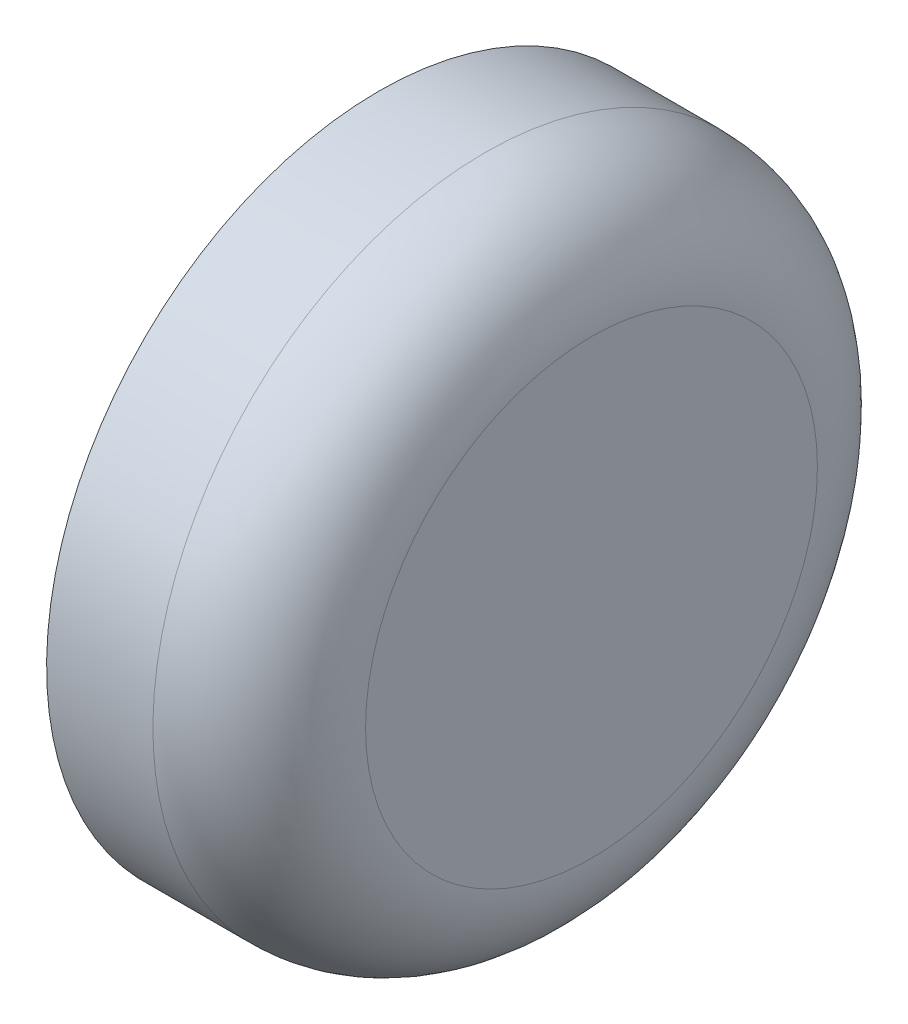
ISO-10303-21;
HEADER;
FILE_DESCRIPTION(('STEP AP214'),'2;1');
FILE_NAME('part.step','',(''),(''),'','','');
FILE_SCHEMA(('AUTOMOTIVE_DESIGN { 1 0 10303 214 1 1 1 1 }'));
ENDSEC;
DATA;
#1=APPLICATION_CONTEXT('core data for automotive mechanical design processes');
#2=APPLICATION_PROTOCOL_DEFINITION('international standard','automotive_design',2000,#1);
#3=PRODUCT_CONTEXT('',#1,'mechanical');
#4=PRODUCT('Part','Part','',(#3));
#5=PRODUCT_RELATED_PRODUCT_CATEGORY('part','',(#4));
#6=PRODUCT_DEFINITION_FORMATION('','',#4);
#7=PRODUCT_DEFINITION_CONTEXT('part definition',#1,'design');
#8=PRODUCT_DEFINITION('design','',#6,#7);
#9=PRODUCT_DEFINITION_SHAPE('','',#8);
#10=(LENGTH_UNIT() NAMED_UNIT(*) SI_UNIT(.MILLI.,.METRE.));
#11=(NAMED_UNIT(*) PLANE_ANGLE_UNIT() SI_UNIT($,.RADIAN.));
#12=(NAMED_UNIT(*) SI_UNIT($,.STERADIAN.) SOLID_ANGLE_UNIT());
#13=UNCERTAINTY_MEASURE_WITH_UNIT(LENGTH_MEASURE(1.E-05),#10,'distance_accuracy_value','');
#14=(GEOMETRIC_REPRESENTATION_CONTEXT(3) GLOBAL_UNCERTAINTY_ASSIGNED_CONTEXT((#13)) GLOBAL_UNIT_ASSIGNED_CONTEXT((#10,
#11,#12)) REPRESENTATION_CONTEXT('',''));
#15=CARTESIAN_POINT('',(0.,0.,0.));
#16=DIRECTION('',(0.,0.,1.));
#17=DIRECTION('',(1.,0.,0.));
#18=AXIS2_PLACEMENT_3D('',#15,#16,#17);
#19=CARTESIAN_POINT('',(-0.270364285309383,-0.332340218761648,0.1012));
#20=DIRECTION('',(1.,0.,0.));
#21=DIRECTION('',(0.,1.,0.));
#22=AXIS2_PLACEMENT_3D('',#19,#20,#21);
#23=PLANE('',#22);
#24=CARTESIAN_POINT('',(-0.270364285309383,-0.332340218761648,0.1012));
#25=DIRECTION('',(-1.,0.,0.));
#26=DIRECTION('',(0.,0.,1.));
#27=AXIS2_PLACEMENT_3D('',#24,#25,#26);
#28=CIRCLE('',#27,0.02125);
#29=CARTESIAN_POINT('',(-0.270364285309383,-0.332340218761648,0.12245));
#30=VERTEX_POINT('',#29);
#31=CARTESIAN_POINT('',(-0.270364285309383,-0.311090218761648,0.1012));
#32=VERTEX_POINT('',#31);
#33=EDGE_CURVE('E41',#30,#32,#28,.T.);
#34=ORIENTED_EDGE('',*,*,#33,.F.);
#35=CARTESIAN_POINT('',(-0.270364285309383,-0.332340218761648,0.1012));
#36=DIRECTION('',(-1.,0.,0.));
#37=DIRECTION('',(0.,0.,-1.));
#38=AXIS2_PLACEMENT_3D('',#35,#36,#37);
#39=CIRCLE('',#38,0.0212499999999999);
#40=CARTESIAN_POINT('',(-0.270364285309383,-0.332340218761648,0.07995));
#41=VERTEX_POINT('',#40);
#42=EDGE_CURVE('E43',#41,#30,#39,.T.);
#43=ORIENTED_EDGE('',*,*,#42,.F.);
#44=CARTESIAN_POINT('',(-0.270364285309383,-0.332340218761648,0.1012));
#45=DIRECTION('',(-1.,0.,0.));
#46=DIRECTION('',(0.,1.,0.));
#47=AXIS2_PLACEMENT_3D('',#44,#45,#46);
#48=CIRCLE('',#47,0.02125);
#49=EDGE_CURVE('E35',#32,#41,#48,.T.);
#50=ORIENTED_EDGE('',*,*,#49,.F.);
#51=EDGE_LOOP('',(#34,#43,#50));
#52=FACE_BOUND('',#51,.T.);
#53=ADVANCED_FACE('F17',(#52),#23,.T.);
#54=CARTESIAN_POINT('',(-0.280364285309383,-0.332340218761648,0.1012));
#55=DIRECTION('',(1.,0.,0.));
#56=DIRECTION('',(0.,0.,1.));
#57=AXIS2_PLACEMENT_3D('',#54,#55,#56);
#58=TOROIDAL_SURFACE('',#57,0.02125,0.01);
#59=ORIENTED_EDGE('',*,*,#42,.T.);
#60=ORIENTED_EDGE('',*,*,#33,.T.);
#61=ORIENTED_EDGE('',*,*,#49,.T.);
#62=EDGE_LOOP('',(#59,#60,#61));
#63=FACE_BOUND('',#62,.T.);
#64=CARTESIAN_POINT('',(-0.280364285309383,-0.332340218761648,0.1012));
#65=DIRECTION('',(1.,0.,0.));
#66=DIRECTION('',(0.,1.,0.));
#67=AXIS2_PLACEMENT_3D('',#64,#65,#66);
#68=CIRCLE('',#67,0.03125);
#69=CARTESIAN_POINT('',(-0.280364285309383,-0.301090218761648,0.1012));
#70=VERTEX_POINT('',#69);
#71=EDGE_CURVE('E27',#70,#70,#68,.F.);
#72=ORIENTED_EDGE('',*,*,#71,.F.);
#73=EDGE_LOOP('',(#72));
#74=FACE_BOUND('',#73,.T.);
#75=ADVANCED_FACE('F44',(#63,#74),#58,.T.);
#76=CARTESIAN_POINT('',(-0.270364285309383,-0.332340218761648,0.1012));
#77=DIRECTION('',(1.,0.,0.));
#78=DIRECTION('',(0.,1.,0.));
#79=AXIS2_PLACEMENT_3D('',#76,#77,#78);
#80=CYLINDRICAL_SURFACE('',#79,0.03125);
#81=CARTESIAN_POINT('',(-0.290364285309383,-0.332340218761648,0.1012));
#82=DIRECTION('',(1.,0.,0.));
#83=DIRECTION('',(0.,1.,0.));
#84=AXIS2_PLACEMENT_3D('',#81,#82,#83);
#85=CIRCLE('',#84,0.03125);
#86=CARTESIAN_POINT('',(-0.290364285309383,-0.301090218761648,0.1012));
#87=VERTEX_POINT('',#86);
#88=EDGE_CURVE('E11',#87,#87,#85,.T.);
#89=ORIENTED_EDGE('',*,*,#88,.T.);
#90=EDGE_LOOP('',(#89));
#91=FACE_BOUND('',#90,.T.);
#92=ORIENTED_EDGE('',*,*,#71,.T.);
#93=EDGE_LOOP('',(#92));
#94=FACE_BOUND('',#93,.T.);
#95=ADVANCED_FACE('F82',(#91,#94),#80,.T.);
#96=CARTESIAN_POINT('',(-0.290364285309383,-0.332340218761648,0.1012));
#97=DIRECTION('',(1.,0.,0.));
#98=DIRECTION('',(0.,1.,0.));
#99=AXIS2_PLACEMENT_3D('',#96,#97,#98);
#100=PLANE('',#99);
#101=ORIENTED_EDGE('',*,*,#88,.F.);
#102=EDGE_LOOP('',(#101));
#103=FACE_BOUND('',#102,.T.);
#104=ADVANCED_FACE('F92',(#103),#100,.F.);
#105=CLOSED_SHELL('',(#53,#75,#95,#104));
#106=MANIFOLD_SOLID_BREP('B1',#105);
#107=ADVANCED_BREP_SHAPE_REPRESENTATION('',(#18,#106),#14);
#108=SHAPE_DEFINITION_REPRESENTATION(#9,#107);
ENDSEC;
END-ISO-10303-21;
